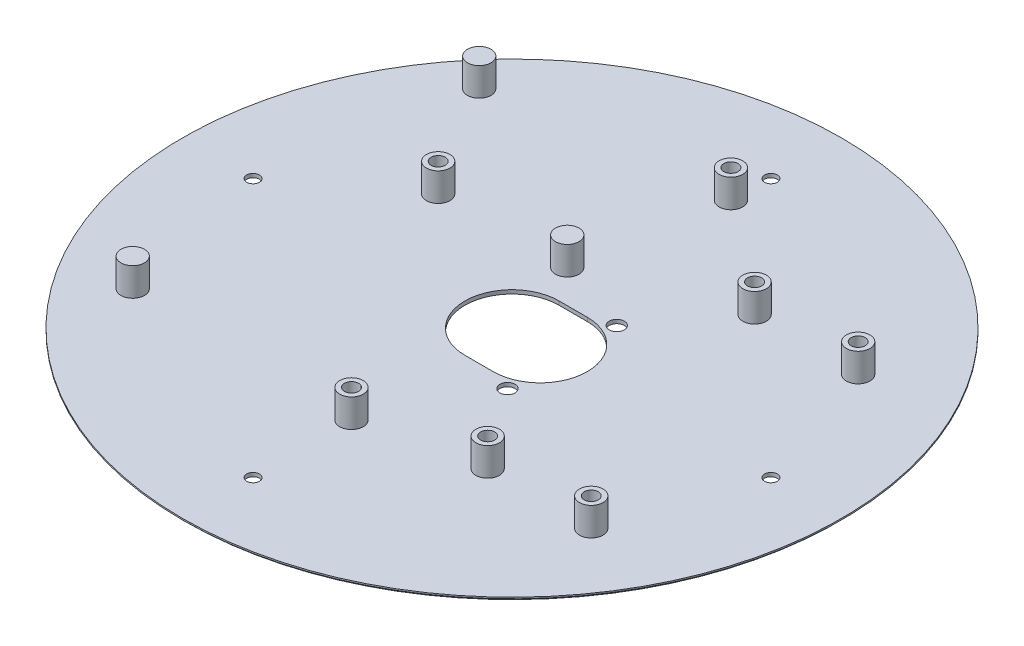
ISO-10303-21;
HEADER;
FILE_DESCRIPTION(('STEP AP214'),'2;1');
FILE_NAME('part.step','',(''),(''),'','','');
FILE_SCHEMA(('AUTOMOTIVE_DESIGN { 1 0 10303 214 1 1 1 1 }'));
ENDSEC;
DATA;
#1=APPLICATION_CONTEXT('core data for automotive mechanical design processes');
#2=APPLICATION_PROTOCOL_DEFINITION('international standard','automotive_design',2000,#1);
#3=PRODUCT_CONTEXT('',#1,'mechanical');
#4=PRODUCT('Part','Part','',(#3));
#5=PRODUCT_RELATED_PRODUCT_CATEGORY('part','',(#4));
#6=PRODUCT_DEFINITION_FORMATION('','',#4);
#7=PRODUCT_DEFINITION_CONTEXT('part definition',#1,'design');
#8=PRODUCT_DEFINITION('design','',#6,#7);
#9=PRODUCT_DEFINITION_SHAPE('','',#8);
#10=(LENGTH_UNIT() NAMED_UNIT(*) SI_UNIT(.MILLI.,.METRE.));
#11=(NAMED_UNIT(*) PLANE_ANGLE_UNIT() SI_UNIT($,.RADIAN.));
#12=(NAMED_UNIT(*) SI_UNIT($,.STERADIAN.) SOLID_ANGLE_UNIT());
#13=UNCERTAINTY_MEASURE_WITH_UNIT(LENGTH_MEASURE(1.E-05),#10,'distance_accuracy_value','');
#14=(GEOMETRIC_REPRESENTATION_CONTEXT(3) GLOBAL_UNCERTAINTY_ASSIGNED_CONTEXT((#13)) GLOBAL_UNIT_ASSIGNED_CONTEXT((#10,
#11,#12)) REPRESENTATION_CONTEXT('',''));
#15=CARTESIAN_POINT('',(0.,0.,0.));
#16=DIRECTION('',(0.,0.,1.));
#17=DIRECTION('',(1.,0.,0.));
#18=AXIS2_PLACEMENT_3D('',#15,#16,#17);
#19=CARTESIAN_POINT('',(0.,0.8,0.));
#20=DIRECTION('',(0.,-1.,0.));
#21=DIRECTION('',(0.,0.,-1.));
#22=AXIS2_PLACEMENT_3D('',#19,#20,#21);
#23=CYLINDRICAL_SURFACE('',#22,70.);
#24=CARTESIAN_POINT('',(0.,0.500000000000014,0.));
#25=DIRECTION('',(0.,1.,0.));
#26=DIRECTION('',(0.,0.,1.));
#27=AXIS2_PLACEMENT_3D('',#24,#25,#26);
#28=CIRCLE('',#27,70.);
#29=CARTESIAN_POINT('',(0.,0.500000000000014,70.));
#30=VERTEX_POINT('',#29);
#31=EDGE_CURVE('E41',#30,#30,#28,.T.);
#32=ORIENTED_EDGE('',*,*,#31,.T.);
#33=EDGE_LOOP('',(#32));
#34=FACE_BOUND('',#33,.T.);
#35=CARTESIAN_POINT('',(0.,0.8,0.));
#36=DIRECTION('',(0.,1.,0.));
#37=DIRECTION('',(0.,0.,1.));
#38=AXIS2_PLACEMENT_3D('',#35,#36,#37);
#39=CIRCLE('',#38,70.);
#40=CARTESIAN_POINT('',(0.,0.8,70.));
#41=VERTEX_POINT('',#40);
#42=EDGE_CURVE('E80',#41,#41,#39,.T.);
#43=ORIENTED_EDGE('',*,*,#42,.F.);
#44=EDGE_LOOP('',(#43));
#45=FACE_BOUND('',#44,.T.);
#46=ADVANCED_FACE('F33',(#34,#45),#23,.T.);
#47=CARTESIAN_POINT('',(0.,0.8,0.));
#48=DIRECTION('',(0.,1.,0.));
#49=DIRECTION('',(0.,0.,1.));
#50=AXIS2_PLACEMENT_3D('',#47,#48,#49);
#51=PLANE('',#50);
#52=CARTESIAN_POINT('',(10.6441872975892,0.8,11.6052369361815));
#53=DIRECTION('',(0.,1.,0.));
#54=DIRECTION('',(0.,0.,1.));
#55=AXIS2_PLACEMENT_3D('',#52,#53,#54);
#56=CIRCLE('',#55,1.6);
#57=CARTESIAN_POINT('',(10.6441872975892,0.8,13.2052369361815));
#58=VERTEX_POINT('',#57);
#59=EDGE_CURVE('E716',#58,#58,#56,.T.);
#60=ORIENTED_EDGE('',*,*,#59,.F.);
#61=EDGE_LOOP('',(#60));
#62=FACE_BOUND('',#61,.T.);
#63=CARTESIAN_POINT('',(10.6441872975892,0.8,-11.6052369361815));
#64=DIRECTION('',(0.,1.,0.));
#65=DIRECTION('',(0.,0.,1.));
#66=AXIS2_PLACEMENT_3D('',#63,#64,#65);
#67=CIRCLE('',#66,1.6);
#68=CARTESIAN_POINT('',(10.6441872975892,0.8,-10.0052369361815));
#69=VERTEX_POINT('',#68);
#70=EDGE_CURVE('E697',#69,#69,#67,.T.);
#71=ORIENTED_EDGE('',*,*,#70,.F.);
#72=EDGE_LOOP('',(#71));
#73=FACE_BOUND('',#72,.T.);
#74=CARTESIAN_POINT('',(55.,0.8,0.));
#75=DIRECTION('',(0.,1.,0.));
#76=DIRECTION('',(0.,0.,1.));
#77=AXIS2_PLACEMENT_3D('',#74,#75,#76);
#78=CIRCLE('',#77,1.35);
#79=CARTESIAN_POINT('',(55.,0.8,1.35));
#80=VERTEX_POINT('',#79);
#81=EDGE_CURVE('E706',#80,#80,#78,.F.);
#82=ORIENTED_EDGE('',*,*,#81,.T.);
#83=EDGE_LOOP('',(#82));
#84=FACE_BOUND('',#83,.T.);
#85=CARTESIAN_POINT('',(0.,0.8,-55.));
#86=DIRECTION('',(0.,1.,0.));
#87=DIRECTION('',(0.,0.,1.));
#88=AXIS2_PLACEMENT_3D('',#85,#86,#87);
#89=CIRCLE('',#88,1.35);
#90=CARTESIAN_POINT('',(0.,0.8,-53.65));
#91=VERTEX_POINT('',#90);
#92=EDGE_CURVE('E700',#91,#91,#89,.F.);
#93=ORIENTED_EDGE('',*,*,#92,.T.);
#94=EDGE_LOOP('',(#93));
#95=FACE_BOUND('',#94,.T.);
#96=CARTESIAN_POINT('',(0.,0.8,55.));
#97=DIRECTION('',(0.,1.,0.));
#98=DIRECTION('',(0.,0.,1.));
#99=AXIS2_PLACEMENT_3D('',#96,#97,#98);
#100=CIRCLE('',#99,1.35);
#101=CARTESIAN_POINT('',(0.,0.8,56.35));
#102=VERTEX_POINT('',#101);
#103=EDGE_CURVE('E693',#102,#102,#100,.F.);
#104=ORIENTED_EDGE('',*,*,#103,.T.);
#105=EDGE_LOOP('',(#104));
#106=FACE_BOUND('',#105,.T.);
#107=CARTESIAN_POINT('',(-55.,0.8,0.));
#108=DIRECTION('',(0.,1.,0.));
#109=DIRECTION('',(0.,0.,1.));
#110=AXIS2_PLACEMENT_3D('',#107,#108,#109);
#111=CIRCLE('',#110,1.35);
#112=CARTESIAN_POINT('',(-55.,0.8,1.35));
#113=VERTEX_POINT('',#112);
#114=EDGE_CURVE('E687',#113,#113,#111,.F.);
#115=ORIENTED_EDGE('',*,*,#114,.T.);
#116=EDGE_LOOP('',(#115));
#117=FACE_BOUND('',#116,.T.);
#118=CARTESIAN_POINT('',(-47.5339886149693,0.8,33.0275201405061));
#119=DIRECTION('',(0.,1.,0.));
#120=DIRECTION('',(0.,0.,1.));
#121=AXIS2_PLACEMENT_3D('',#118,#119,#120);
#122=CIRCLE('',#121,2.5);
#123=CARTESIAN_POINT('',(-47.5339886149693,0.8,35.5275201405061));
#124=VERTEX_POINT('',#123);
#125=EDGE_CURVE('E112',#124,#124,#122,.T.);
#126=ORIENTED_EDGE('',*,*,#125,.F.);
#127=EDGE_LOOP('',(#126));
#128=FACE_BOUND('',#127,.T.);
#129=CARTESIAN_POINT('',(-5.29337774476633,0.8,-17.0303035725372));
#130=DIRECTION('',(0.,1.,0.));
#131=DIRECTION('',(0.,0.,1.));
#132=AXIS2_PLACEMENT_3D('',#129,#130,#131);
#133=CIRCLE('',#132,2.5);
#134=CARTESIAN_POINT('',(-5.29337774476633,0.8,-14.5303035725372));
#135=VERTEX_POINT('',#134);
#136=EDGE_CURVE('E116',#135,#135,#133,.T.);
#137=ORIENTED_EDGE('',*,*,#136,.F.);
#138=EDGE_LOOP('',(#137));
#139=FACE_BOUND('',#138,.T.);
#140=CARTESIAN_POINT('',(-47.5339886149701,0.8,-40.5718419580567));
#141=DIRECTION('',(0.,1.,0.));
#142=DIRECTION('',(0.,0.,1.));
#143=AXIS2_PLACEMENT_3D('',#140,#141,#142);
#144=CIRCLE('',#143,2.5);
#145=CARTESIAN_POINT('',(-47.5339886149701,0.8,-38.0718419580567));
#146=VERTEX_POINT('',#145);
#147=EDGE_CURVE('E121',#146,#146,#144,.T.);
#148=ORIENTED_EDGE('',*,*,#147,.F.);
#149=EDGE_LOOP('',(#148));
#150=FACE_BOUND('',#149,.T.);
#151=CARTESIAN_POINT('',(-0.1529925208913,0.8,33.9401713357412));
#152=DIRECTION('',(0.,1.,0.));
#153=DIRECTION('',(0.,0.,1.));
#154=AXIS2_PLACEMENT_3D('',#151,#152,#153);
#155=CIRCLE('',#154,2.5);
#156=CARTESIAN_POINT('',(-0.1529925208913,0.8,36.4401713357412));
#157=VERTEX_POINT('',#156);
#158=EDGE_CURVE('E136',#157,#157,#155,.T.);
#159=ORIENTED_EDGE('',*,*,#158,.F.);
#160=EDGE_LOOP('',(#159));
#161=FACE_BOUND('',#160,.T.);
#162=CARTESIAN_POINT('',(23.2606500317656,0.8,28.4285469058722));
#163=DIRECTION('',(0.,1.,0.));
#164=DIRECTION('',(0.,0.,1.));
#165=AXIS2_PLACEMENT_3D('',#162,#163,#164);
#166=CIRCLE('',#165,2.5);
#167=CARTESIAN_POINT('',(23.2606500317656,0.8,30.9285469058722));
#168=VERTEX_POINT('',#167);
#169=EDGE_CURVE('E145',#168,#168,#166,.T.);
#170=ORIENTED_EDGE('',*,*,#169,.F.);
#171=EDGE_LOOP('',(#170));
#172=FACE_BOUND('',#171,.T.);
#173=CARTESIAN_POINT('',(45.2606500317656,0.8,28.4285469058722));
#174=DIRECTION('',(0.,1.,0.));
#175=DIRECTION('',(0.,0.,1.));
#176=AXIS2_PLACEMENT_3D('',#173,#174,#175);
#177=CIRCLE('',#176,2.5);
#178=CARTESIAN_POINT('',(45.2606500317656,0.8,30.9285469058722));
#179=VERTEX_POINT('',#178);
#180=EDGE_CURVE('E154',#179,#179,#177,.T.);
#181=ORIENTED_EDGE('',*,*,#180,.F.);
#182=EDGE_LOOP('',(#181));
#183=FACE_BOUND('',#182,.T.);
#184=CARTESIAN_POINT('',(45.2606500317656,0.8,-28.2714530941278));
#185=DIRECTION('',(0.,1.,0.));
#186=DIRECTION('',(0.,0.,1.));
#187=AXIS2_PLACEMENT_3D('',#184,#185,#186);
#188=CIRCLE('',#187,2.5);
#189=CARTESIAN_POINT('',(45.2606500317656,0.8,-25.7714530941278));
#190=VERTEX_POINT('',#189);
#191=EDGE_CURVE('E163',#190,#190,#188,.T.);
#192=ORIENTED_EDGE('',*,*,#191,.F.);
#193=EDGE_LOOP('',(#192));
#194=FACE_BOUND('',#193,.T.);
#195=CARTESIAN_POINT('',(23.2606500317656,0.8,-28.2714530941278));
#196=DIRECTION('',(0.,1.,0.));
#197=DIRECTION('',(0.,0.,1.));
#198=AXIS2_PLACEMENT_3D('',#195,#196,#197);
#199=CIRCLE('',#198,2.5);
#200=CARTESIAN_POINT('',(23.2606500317656,0.8,-25.7714530941278));
#201=VERTEX_POINT('',#200);
#202=EDGE_CURVE('E172',#201,#201,#199,.T.);
#203=ORIENTED_EDGE('',*,*,#202,.F.);
#204=EDGE_LOOP('',(#203));
#205=FACE_BOUND('',#204,.T.);
#206=CARTESIAN_POINT('',(-0.280707316952809,0.8,-46.7799523134917));
#207=DIRECTION('',(0.,1.,0.));
#208=DIRECTION('',(0.,0.,1.));
#209=AXIS2_PLACEMENT_3D('',#206,#207,#208);
#210=CIRCLE('',#209,2.5);
#211=CARTESIAN_POINT('',(-0.280707316952809,0.8,-44.2799523134917));
#212=VERTEX_POINT('',#211);
#213=EDGE_CURVE('E181',#212,#212,#210,.T.);
#214=ORIENTED_EDGE('',*,*,#213,.F.);
#215=EDGE_LOOP('',(#214));
#216=FACE_BOUND('',#215,.T.);
#217=CARTESIAN_POINT('',(-32.5331874532012,0.8,-16.8548841204044));
#218=DIRECTION('',(0.,1.,0.));
#219=DIRECTION('',(0.,0.,1.));
#220=AXIS2_PLACEMENT_3D('',#217,#218,#219);
#221=CIRCLE('',#220,2.5);
#222=CARTESIAN_POINT('',(-32.5331874532012,0.8,-14.3548841204044));
#223=VERTEX_POINT('',#222);
#224=EDGE_CURVE('E110',#223,#223,#221,.T.);
#225=ORIENTED_EDGE('',*,*,#224,.F.);
#226=EDGE_LOOP('',(#225));
#227=FACE_BOUND('',#226,.T.);
#228=CARTESIAN_POINT('',(6.,0.8,0.));
#229=DIRECTION('',(0.,1.,0.));
#230=DIRECTION('',(0.,0.,1.));
#231=AXIS2_PLACEMENT_3D('',#228,#229,#230);
#232=CIRCLE('',#231,10.);
#233=CARTESIAN_POINT('',(6.,0.8,-10.));
#234=VERTEX_POINT('',#233);
#235=CARTESIAN_POINT('',(6.,0.8,10.));
#236=VERTEX_POINT('',#235);
#237=EDGE_CURVE('E84',#234,#236,#232,.F.);
#238=ORIENTED_EDGE('',*,*,#237,.T.);
#239=DIRECTION('',(-1.,0.,0.));
#240=VECTOR('',#239,1.);
#241=CARTESIAN_POINT('',(6.,0.8,10.));
#242=LINE('',#241,#240);
#243=CARTESIAN_POINT('',(0.,0.8,10.));
#244=VERTEX_POINT('',#243);
#245=EDGE_CURVE('E73',#236,#244,#242,.T.);
#246=ORIENTED_EDGE('',*,*,#245,.T.);
#247=CARTESIAN_POINT('',(0.,0.8,0.));
#248=DIRECTION('',(0.,1.,0.));
#249=DIRECTION('',(0.,0.,1.));
#250=AXIS2_PLACEMENT_3D('',#247,#248,#249);
#251=CIRCLE('',#250,10.);
#252=CARTESIAN_POINT('',(0.,0.8,-10.));
#253=VERTEX_POINT('',#252);
#254=EDGE_CURVE('E95',#244,#253,#251,.F.);
#255=ORIENTED_EDGE('',*,*,#254,.T.);
#256=DIRECTION('',(1.,0.,0.));
#257=VECTOR('',#256,1.);
#258=CARTESIAN_POINT('',(6.,0.8,-10.));
#259=LINE('',#258,#257);
#260=EDGE_CURVE('E91',#253,#234,#259,.T.);
#261=ORIENTED_EDGE('',*,*,#260,.T.);
#262=EDGE_LOOP('',(#238,#246,#255,#261));
#263=FACE_BOUND('',#262,.T.);
#264=ORIENTED_EDGE('',*,*,#42,.T.);
#265=EDGE_LOOP('',(#264));
#266=FACE_BOUND('',#265,.T.);
#267=ADVANCED_FACE('F89',(#62,#73,#84,#95,#106,#117,#128,#139,#150,#161,#172,#183,#194,#205,
#216,#227,#263,#266),#51,.T.);
#268=CARTESIAN_POINT('',(0.,0.,0.));
#269=DIRECTION('',(0.,1.,0.));
#270=DIRECTION('',(0.,0.,1.));
#271=AXIS2_PLACEMENT_3D('',#268,#269,#270);
#272=PLANE('',#271);
#273=CARTESIAN_POINT('',(10.6441872975892,0.,11.6052369361815));
#274=DIRECTION('',(0.,-1.,0.));
#275=DIRECTION('',(0.,0.,-1.));
#276=AXIS2_PLACEMENT_3D('',#273,#274,#275);
#277=CIRCLE('',#276,1.6);
#278=CARTESIAN_POINT('',(10.6441872975892,0.,10.0052369361815));
#279=VERTEX_POINT('',#278);
#280=EDGE_CURVE('E718',#279,#279,#277,.T.);
#281=ORIENTED_EDGE('',*,*,#280,.F.);
#282=EDGE_LOOP('',(#281));
#283=FACE_BOUND('',#282,.T.);
#284=CARTESIAN_POINT('',(10.6441872975892,0.,-11.6052369361815));
#285=DIRECTION('',(0.,-1.,0.));
#286=DIRECTION('',(0.,0.,-1.));
#287=AXIS2_PLACEMENT_3D('',#284,#285,#286);
#288=CIRCLE('',#287,1.6);
#289=CARTESIAN_POINT('',(10.6441872975892,0.,-13.2052369361815));
#290=VERTEX_POINT('',#289);
#291=EDGE_CURVE('E713',#290,#290,#288,.T.);
#292=ORIENTED_EDGE('',*,*,#291,.F.);
#293=EDGE_LOOP('',(#292));
#294=FACE_BOUND('',#293,.T.);
#295=CARTESIAN_POINT('',(55.,0.,0.));
#296=DIRECTION('',(0.,-1.,0.));
#297=DIRECTION('',(0.,0.,-1.));
#298=AXIS2_PLACEMENT_3D('',#295,#296,#297);
#299=CIRCLE('',#298,1.35);
#300=CARTESIAN_POINT('',(55.,0.,-1.35));
#301=VERTEX_POINT('',#300);
#302=EDGE_CURVE('E690',#301,#301,#299,.T.);
#303=ORIENTED_EDGE('',*,*,#302,.F.);
#304=EDGE_LOOP('',(#303));
#305=FACE_BOUND('',#304,.T.);
#306=CARTESIAN_POINT('',(0.,0.,-55.));
#307=DIRECTION('',(0.,-1.,0.));
#308=DIRECTION('',(0.,0.,-1.));
#309=AXIS2_PLACEMENT_3D('',#306,#307,#308);
#310=CIRCLE('',#309,1.35);
#311=CARTESIAN_POINT('',(0.,0.,-56.35));
#312=VERTEX_POINT('',#311);
#313=EDGE_CURVE('E703',#312,#312,#310,.T.);
#314=ORIENTED_EDGE('',*,*,#313,.F.);
#315=EDGE_LOOP('',(#314));
#316=FACE_BOUND('',#315,.T.);
#317=CARTESIAN_POINT('',(0.,0.,55.));
#318=DIRECTION('',(0.,-1.,0.));
#319=DIRECTION('',(0.,0.,-1.));
#320=AXIS2_PLACEMENT_3D('',#317,#318,#319);
#321=CIRCLE('',#320,1.35);
#322=CARTESIAN_POINT('',(0.,0.,53.65));
#323=VERTEX_POINT('',#322);
#324=EDGE_CURVE('E696',#323,#323,#321,.T.);
#325=ORIENTED_EDGE('',*,*,#324,.F.);
#326=EDGE_LOOP('',(#325));
#327=FACE_BOUND('',#326,.T.);
#328=CARTESIAN_POINT('',(-55.,0.,0.));
#329=DIRECTION('',(0.,-1.,0.));
#330=DIRECTION('',(0.,0.,-1.));
#331=AXIS2_PLACEMENT_3D('',#328,#329,#330);
#332=CIRCLE('',#331,1.35);
#333=CARTESIAN_POINT('',(-55.,0.,-1.35));
#334=VERTEX_POINT('',#333);
#335=EDGE_CURVE('E683',#334,#334,#332,.T.);
#336=ORIENTED_EDGE('',*,*,#335,.F.);
#337=EDGE_LOOP('',(#336));
#338=FACE_BOUND('',#337,.T.);
#339=CARTESIAN_POINT('',(0.,0.,0.));
#340=DIRECTION('',(0.,1.,0.));
#341=DIRECTION('',(0.,0.,1.));
#342=AXIS2_PLACEMENT_3D('',#339,#340,#341);
#343=CIRCLE('',#342,69.5);
#344=CARTESIAN_POINT('',(0.,0.,69.5));
#345=VERTEX_POINT('',#344);
#346=EDGE_CURVE('E11',#345,#345,#343,.F.);
#347=ORIENTED_EDGE('',*,*,#346,.T.);
#348=EDGE_LOOP('',(#347));
#349=FACE_BOUND('',#348,.T.);
#350=CARTESIAN_POINT('',(-0.280707316952809,0.,-46.7799523134917));
#351=DIRECTION('',(0.,1.,0.));
#352=DIRECTION('',(0.,0.,1.));
#353=AXIS2_PLACEMENT_3D('',#350,#351,#352);
#354=CIRCLE('',#353,1.41008319207524);
#355=CARTESIAN_POINT('',(-0.280707316952809,0.,-45.3698691214165));
#356=VERTEX_POINT('',#355);
#357=EDGE_CURVE('E650',#356,#356,#354,.T.);
#358=ORIENTED_EDGE('',*,*,#357,.T.);
#359=EDGE_LOOP('',(#358));
#360=FACE_BOUND('',#359,.T.);
#361=CARTESIAN_POINT('',(-0.1529925208913,0.,33.9401713357412));
#362=DIRECTION('',(0.,1.,0.));
#363=DIRECTION('',(0.,0.,1.));
#364=AXIS2_PLACEMENT_3D('',#361,#362,#363);
#365=CIRCLE('',#364,1.5);
#366=CARTESIAN_POINT('',(-0.1529925208913,0.,35.4401713357412));
#367=VERTEX_POINT('',#366);
#368=EDGE_CURVE('E654',#367,#367,#365,.T.);
#369=ORIENTED_EDGE('',*,*,#368,.T.);
#370=EDGE_LOOP('',(#369));
#371=FACE_BOUND('',#370,.T.);
#372=CARTESIAN_POINT('',(23.2606500317656,0.,28.4285469058722));
#373=DIRECTION('',(0.,1.,0.));
#374=DIRECTION('',(0.,0.,1.));
#375=AXIS2_PLACEMENT_3D('',#372,#373,#374);
#376=CIRCLE('',#375,1.5);
#377=CARTESIAN_POINT('',(23.2606500317656,0.,29.9285469058722));
#378=VERTEX_POINT('',#377);
#379=EDGE_CURVE('E658',#378,#378,#376,.T.);
#380=ORIENTED_EDGE('',*,*,#379,.T.);
#381=EDGE_LOOP('',(#380));
#382=FACE_BOUND('',#381,.T.);
#383=CARTESIAN_POINT('',(45.2606500317656,0.,28.4285469058722));
#384=DIRECTION('',(0.,1.,0.));
#385=DIRECTION('',(0.,0.,1.));
#386=AXIS2_PLACEMENT_3D('',#383,#384,#385);
#387=CIRCLE('',#386,1.50000000000001);
#388=CARTESIAN_POINT('',(45.2606500317656,0.,29.9285469058722));
#389=VERTEX_POINT('',#388);
#390=EDGE_CURVE('E662',#389,#389,#387,.T.);
#391=ORIENTED_EDGE('',*,*,#390,.T.);
#392=EDGE_LOOP('',(#391));
#393=FACE_BOUND('',#392,.T.);
#394=CARTESIAN_POINT('',(45.2606500317656,0.,-28.2714530941278));
#395=DIRECTION('',(0.,1.,0.));
#396=DIRECTION('',(0.,0.,1.));
#397=AXIS2_PLACEMENT_3D('',#394,#395,#396);
#398=CIRCLE('',#397,1.5);
#399=CARTESIAN_POINT('',(45.2606500317656,0.,-26.7714530941278));
#400=VERTEX_POINT('',#399);
#401=EDGE_CURVE('E666',#400,#400,#398,.T.);
#402=ORIENTED_EDGE('',*,*,#401,.T.);
#403=EDGE_LOOP('',(#402));
#404=FACE_BOUND('',#403,.T.);
#405=CARTESIAN_POINT('',(23.2606500317656,0.,-28.2714530941278));
#406=DIRECTION('',(0.,1.,0.));
#407=DIRECTION('',(0.,0.,1.));
#408=AXIS2_PLACEMENT_3D('',#405,#406,#407);
#409=CIRCLE('',#408,1.5);
#410=CARTESIAN_POINT('',(23.2606500317656,0.,-26.7714530941278));
#411=VERTEX_POINT('',#410);
#412=EDGE_CURVE('E670',#411,#411,#409,.T.);
#413=ORIENTED_EDGE('',*,*,#412,.T.);
#414=EDGE_LOOP('',(#413));
#415=FACE_BOUND('',#414,.T.);
#416=CARTESIAN_POINT('',(-32.5331874532012,0.,-16.8548841204044));
#417=DIRECTION('',(0.,1.,0.));
#418=DIRECTION('',(0.,0.,1.));
#419=AXIS2_PLACEMENT_3D('',#416,#417,#418);
#420=CIRCLE('',#419,1.5);
#421=CARTESIAN_POINT('',(-32.5331874532012,0.,-15.3548841204044));
#422=VERTEX_POINT('',#421);
#423=EDGE_CURVE('E673',#422,#422,#420,.T.);
#424=ORIENTED_EDGE('',*,*,#423,.T.);
#425=EDGE_LOOP('',(#424));
#426=FACE_BOUND('',#425,.T.);
#427=DIRECTION('',(-1.,0.,0.));
#428=VECTOR('',#427,1.);
#429=CARTESIAN_POINT('',(6.,0.,10.));
#430=LINE('',#429,#428);
#431=CARTESIAN_POINT('',(6.,0.,10.));
#432=VERTEX_POINT('',#431);
#433=CARTESIAN_POINT('',(0.,0.,10.));
#434=VERTEX_POINT('',#433);
#435=EDGE_CURVE('E93',#432,#434,#430,.T.);
#436=ORIENTED_EDGE('',*,*,#435,.F.);
#437=CARTESIAN_POINT('',(6.,0.,0.));
#438=DIRECTION('',(0.,-1.,0.));
#439=DIRECTION('',(0.,0.,-1.));
#440=AXIS2_PLACEMENT_3D('',#437,#438,#439);
#441=CIRCLE('',#440,10.);
#442=CARTESIAN_POINT('',(6.,0.,-10.));
#443=VERTEX_POINT('',#442);
#444=EDGE_CURVE('E56',#443,#432,#441,.T.);
#445=ORIENTED_EDGE('',*,*,#444,.F.);
#446=DIRECTION('',(1.,0.,0.));
#447=VECTOR('',#446,1.);
#448=CARTESIAN_POINT('',(6.,0.,-10.));
#449=LINE('',#448,#447);
#450=CARTESIAN_POINT('',(0.,0.,-10.));
#451=VERTEX_POINT('',#450);
#452=EDGE_CURVE('E86',#451,#443,#449,.T.);
#453=ORIENTED_EDGE('',*,*,#452,.F.);
#454=CARTESIAN_POINT('',(0.,0.,0.));
#455=DIRECTION('',(0.,-1.,0.));
#456=DIRECTION('',(0.,0.,-1.));
#457=AXIS2_PLACEMENT_3D('',#454,#455,#456);
#458=CIRCLE('',#457,10.);
#459=EDGE_CURVE('E100',#434,#451,#458,.T.);
#460=ORIENTED_EDGE('',*,*,#459,.F.);
#461=EDGE_LOOP('',(#436,#445,#453,#460));
#462=FACE_BOUND('',#461,.T.);
#463=ADVANCED_FACE('F207',(#283,#294,#305,#316,#327,#338,#349,#360,#371,#382,#393,#404,#415,
#426,#462),#272,.F.);
#464=CARTESIAN_POINT('',(6.,0.801,0.));
#465=DIRECTION('',(0.,-1.,0.));
#466=DIRECTION('',(0.,0.,-1.));
#467=AXIS2_PLACEMENT_3D('',#464,#465,#466);
#468=CYLINDRICAL_SURFACE('',#467,10.);
#469=DIRECTION('',(0.,-1.,0.));
#470=VECTOR('',#469,1.);
#471=CARTESIAN_POINT('',(6.,0.801,-10.));
#472=LINE('',#471,#470);
#473=EDGE_CURVE('E81',#234,#443,#472,.T.);
#474=ORIENTED_EDGE('',*,*,#473,.T.);
#475=ORIENTED_EDGE('',*,*,#444,.T.);
#476=DIRECTION('',(0.,-1.,0.));
#477=VECTOR('',#476,1.);
#478=CARTESIAN_POINT('',(6.,0.801,10.));
#479=LINE('',#478,#477);
#480=EDGE_CURVE('E75',#236,#432,#479,.T.);
#481=ORIENTED_EDGE('',*,*,#480,.F.);
#482=ORIENTED_EDGE('',*,*,#237,.F.);
#483=EDGE_LOOP('',(#474,#475,#481,#482));
#484=FACE_BOUND('',#483,.T.);
#485=ADVANCED_FACE('F83',(#484),#468,.F.);
#486=CARTESIAN_POINT('',(6.,0.801,-10.));
#487=DIRECTION('',(0.,0.,-1.));
#488=DIRECTION('',(-1.,0.,0.));
#489=AXIS2_PLACEMENT_3D('',#486,#487,#488);
#490=PLANE('',#489);
#491=DIRECTION('',(0.,-1.,0.));
#492=VECTOR('',#491,1.);
#493=CARTESIAN_POINT('',(0.,0.801,-10.));
#494=LINE('',#493,#492);
#495=EDGE_CURVE('E106',#253,#451,#494,.T.);
#496=ORIENTED_EDGE('',*,*,#495,.T.);
#497=ORIENTED_EDGE('',*,*,#452,.T.);
#498=ORIENTED_EDGE('',*,*,#473,.F.);
#499=ORIENTED_EDGE('',*,*,#260,.F.);
#500=EDGE_LOOP('',(#496,#497,#498,#499));
#501=FACE_BOUND('',#500,.T.);
#502=ADVANCED_FACE('F205',(#501),#490,.F.);
#503=CARTESIAN_POINT('',(0.,0.801,0.));
#504=DIRECTION('',(0.,-1.,0.));
#505=DIRECTION('',(0.,0.,-1.));
#506=AXIS2_PLACEMENT_3D('',#503,#504,#505);
#507=CYLINDRICAL_SURFACE('',#506,10.);
#508=DIRECTION('',(0.,-1.,0.));
#509=VECTOR('',#508,1.);
#510=CARTESIAN_POINT('',(0.,0.801,10.));
#511=LINE('',#510,#509);
#512=EDGE_CURVE('E48',#244,#434,#511,.T.);
#513=ORIENTED_EDGE('',*,*,#512,.T.);
#514=ORIENTED_EDGE('',*,*,#459,.T.);
#515=ORIENTED_EDGE('',*,*,#495,.F.);
#516=ORIENTED_EDGE('',*,*,#254,.F.);
#517=EDGE_LOOP('',(#513,#514,#515,#516));
#518=FACE_BOUND('',#517,.T.);
#519=ADVANCED_FACE('F201',(#518),#507,.F.);
#520=CARTESIAN_POINT('',(6.,0.801,10.));
#521=DIRECTION('',(0.,0.,1.));
#522=DIRECTION('',(1.,0.,0.));
#523=AXIS2_PLACEMENT_3D('',#520,#521,#522);
#524=PLANE('',#523);
#525=ORIENTED_EDGE('',*,*,#480,.T.);
#526=ORIENTED_EDGE('',*,*,#435,.T.);
#527=ORIENTED_EDGE('',*,*,#512,.F.);
#528=ORIENTED_EDGE('',*,*,#245,.F.);
#529=EDGE_LOOP('',(#525,#526,#527,#528));
#530=FACE_BOUND('',#529,.T.);
#531=ADVANCED_FACE('F74',(#530),#524,.F.);
#532=CARTESIAN_POINT('',(-32.5331874532012,-7.07106781186548,-16.8548841204044));
#533=DIRECTION('',(0.,1.,0.));
#534=DIRECTION('',(0.,0.,1.));
#535=AXIS2_PLACEMENT_3D('',#532,#533,#534);
#536=CYLINDRICAL_SURFACE('',#535,2.5);
#537=ORIENTED_EDGE('',*,*,#224,.T.);
#538=EDGE_LOOP('',(#537));
#539=FACE_BOUND('',#538,.T.);
#540=CARTESIAN_POINT('',(-32.5331874532012,6.8,-16.8548841204044));
#541=DIRECTION('',(0.,1.,0.));
#542=DIRECTION('',(0.,0.,1.));
#543=AXIS2_PLACEMENT_3D('',#540,#541,#542);
#544=CIRCLE('',#543,2.5);
#545=CARTESIAN_POINT('',(-32.5331874532012,6.8,-14.3548841204044));
#546=VERTEX_POINT('',#545);
#547=EDGE_CURVE('E195',#546,#546,#544,.T.);
#548=ORIENTED_EDGE('',*,*,#547,.F.);
#549=EDGE_LOOP('',(#548));
#550=FACE_BOUND('',#549,.T.);
#551=ADVANCED_FACE('F390',(#539,#550),#536,.T.);
#552=CARTESIAN_POINT('',(-32.5331874532012,-7.07106781186548,-16.8548841204044));
#553=DIRECTION('',(0.,1.,0.));
#554=DIRECTION('',(0.,0.,1.));
#555=AXIS2_PLACEMENT_3D('',#552,#553,#554);
#556=CYLINDRICAL_SURFACE('',#555,1.5);
#557=CARTESIAN_POINT('',(-32.5331874532012,6.8,-16.8548841204044));
#558=DIRECTION('',(0.,1.,0.));
#559=DIRECTION('',(0.,0.,1.));
#560=AXIS2_PLACEMENT_3D('',#557,#558,#559);
#561=CIRCLE('',#560,1.5);
#562=CARTESIAN_POINT('',(-32.5331874532012,6.8,-15.3548841204044));
#563=VERTEX_POINT('',#562);
#564=EDGE_CURVE('E190',#563,#563,#561,.T.);
#565=ORIENTED_EDGE('',*,*,#564,.T.);
#566=EDGE_LOOP('',(#565));
#567=FACE_BOUND('',#566,.T.);
#568=ORIENTED_EDGE('',*,*,#423,.F.);
#569=EDGE_LOOP('',(#568));
#570=FACE_BOUND('',#569,.T.);
#571=ADVANCED_FACE('F386',(#567,#570),#556,.F.);
#572=CARTESIAN_POINT('',(-32.5331874532012,6.8,-16.8548841204044));
#573=DIRECTION('',(0.,1.,0.));
#574=DIRECTION('',(0.,0.,1.));
#575=AXIS2_PLACEMENT_3D('',#572,#573,#574);
#576=PLANE('',#575);
#577=ORIENTED_EDGE('',*,*,#547,.T.);
#578=EDGE_LOOP('',(#577));
#579=FACE_BOUND('',#578,.T.);
#580=ORIENTED_EDGE('',*,*,#564,.F.);
#581=EDGE_LOOP('',(#580));
#582=FACE_BOUND('',#581,.T.);
#583=ADVANCED_FACE('F382',(#579,#582),#576,.T.);
#584=CARTESIAN_POINT('',(-0.280707316952809,-7.07106781186548,-46.7799523134917));
#585=DIRECTION('',(0.,1.,0.));
#586=DIRECTION('',(0.,0.,1.));
#587=AXIS2_PLACEMENT_3D('',#584,#585,#586);
#588=CYLINDRICAL_SURFACE('',#587,2.5);
#589=ORIENTED_EDGE('',*,*,#213,.T.);
#590=EDGE_LOOP('',(#589));
#591=FACE_BOUND('',#590,.T.);
#592=CARTESIAN_POINT('',(-0.280707316952809,6.8,-46.7799523134917));
#593=DIRECTION('',(0.,1.,0.));
#594=DIRECTION('',(0.,0.,1.));
#595=AXIS2_PLACEMENT_3D('',#592,#593,#594);
#596=CIRCLE('',#595,2.5);
#597=CARTESIAN_POINT('',(-0.280707316952809,6.8,-44.2799523134917));
#598=VERTEX_POINT('',#597);
#599=EDGE_CURVE('E184',#598,#598,#596,.T.);
#600=ORIENTED_EDGE('',*,*,#599,.F.);
#601=EDGE_LOOP('',(#600));
#602=FACE_BOUND('',#601,.T.);
#603=ADVANCED_FACE('F378',(#591,#602),#588,.T.);
#604=CARTESIAN_POINT('',(-0.280707316952809,-7.07106781186548,-46.7799523134917));
#605=DIRECTION('',(0.,1.,0.));
#606=DIRECTION('',(0.,0.,1.));
#607=AXIS2_PLACEMENT_3D('',#604,#605,#606);
#608=CYLINDRICAL_SURFACE('',#607,1.5);
#609=CARTESIAN_POINT('',(-0.280707316952809,0.8,-46.7799523134917));
#610=DIRECTION('',(0.,1.,0.));
#611=DIRECTION('',(0.,0.,1.));
#612=AXIS2_PLACEMENT_3D('',#609,#610,#611);
#613=CIRCLE('',#612,1.5);
#614=CARTESIAN_POINT('',(-0.280707316952809,0.8,-45.2799523134917));
#615=VERTEX_POINT('',#614);
#616=EDGE_CURVE('E187',#615,#615,#613,.T.);
#617=ORIENTED_EDGE('',*,*,#616,.F.);
#618=EDGE_LOOP('',(#617));
#619=FACE_BOUND('',#618,.T.);
#620=CARTESIAN_POINT('',(-0.280707316952809,6.8,-46.7799523134917));
#621=DIRECTION('',(0.,1.,0.));
#622=DIRECTION('',(0.,0.,1.));
#623=AXIS2_PLACEMENT_3D('',#620,#621,#622);
#624=CIRCLE('',#623,1.5);
#625=CARTESIAN_POINT('',(-0.280707316952809,6.8,-45.2799523134917));
#626=VERTEX_POINT('',#625);
#627=EDGE_CURVE('E178',#626,#626,#624,.T.);
#628=ORIENTED_EDGE('',*,*,#627,.T.);
#629=EDGE_LOOP('',(#628));
#630=FACE_BOUND('',#629,.T.);
#631=ADVANCED_FACE('F374',(#619,#630),#608,.F.);
#632=CARTESIAN_POINT('',(-0.280707316952809,6.8,-46.7799523134917));
#633=DIRECTION('',(0.,1.,0.));
#634=DIRECTION('',(0.,0.,1.));
#635=AXIS2_PLACEMENT_3D('',#632,#633,#634);
#636=PLANE('',#635);
#637=ORIENTED_EDGE('',*,*,#599,.T.);
#638=EDGE_LOOP('',(#637));
#639=FACE_BOUND('',#638,.T.);
#640=ORIENTED_EDGE('',*,*,#627,.F.);
#641=EDGE_LOOP('',(#640));
#642=FACE_BOUND('',#641,.T.);
#643=ADVANCED_FACE('F371',(#639,#642),#636,.T.);
#644=CARTESIAN_POINT('',(-0.280707316952809,0.8,-46.7799523134917));
#645=DIRECTION('',(0.,1.,0.));
#646=DIRECTION('',(0.,0.,1.));
#647=AXIS2_PLACEMENT_3D('',#644,#645,#646);
#648=CIRCLE('',#647,1.41008319207524);
#649=CARTESIAN_POINT('',(-0.280707316952809,0.8,-45.3698691214165));
#650=VERTEX_POINT('',#649);
#651=EDGE_CURVE('E680',#650,#650,#648,.T.);
#652=ORIENTED_EDGE('',*,*,#651,.F.);
#653=EDGE_LOOP('',(#652));
#654=FACE_BOUND('',#653,.T.);
#655=ORIENTED_EDGE('',*,*,#616,.T.);
#656=EDGE_LOOP('',(#655));
#657=FACE_BOUND('',#656,.T.);
#658=ADVANCED_FACE('F218',(#654,#657),#51,.T.);
#659=CARTESIAN_POINT('',(23.2606500317656,-7.07106781186548,-28.2714530941278));
#660=DIRECTION('',(0.,1.,0.));
#661=DIRECTION('',(0.,0.,1.));
#662=AXIS2_PLACEMENT_3D('',#659,#660,#661);
#663=CYLINDRICAL_SURFACE('',#662,2.5);
#664=ORIENTED_EDGE('',*,*,#202,.T.);
#665=EDGE_LOOP('',(#664));
#666=FACE_BOUND('',#665,.T.);
#667=CARTESIAN_POINT('',(23.2606500317656,6.8,-28.2714530941278));
#668=DIRECTION('',(0.,1.,0.));
#669=DIRECTION('',(0.,0.,1.));
#670=AXIS2_PLACEMENT_3D('',#667,#668,#669);
#671=CIRCLE('',#670,2.5);
#672=CARTESIAN_POINT('',(23.2606500317656,6.8,-25.7714530941278));
#673=VERTEX_POINT('',#672);
#674=EDGE_CURVE('E175',#673,#673,#671,.T.);
#675=ORIENTED_EDGE('',*,*,#674,.F.);
#676=EDGE_LOOP('',(#675));
#677=FACE_BOUND('',#676,.T.);
#678=ADVANCED_FACE('F366',(#666,#677),#663,.T.);
#679=CARTESIAN_POINT('',(23.2606500317656,-7.07106781186548,-28.2714530941278));
#680=DIRECTION('',(0.,1.,0.));
#681=DIRECTION('',(0.,0.,1.));
#682=AXIS2_PLACEMENT_3D('',#679,#680,#681);
#683=CYLINDRICAL_SURFACE('',#682,1.5);
#684=CARTESIAN_POINT('',(23.2606500317656,6.8,-28.2714530941278));
#685=DIRECTION('',(0.,1.,0.));
#686=DIRECTION('',(0.,0.,1.));
#687=AXIS2_PLACEMENT_3D('',#684,#685,#686);
#688=CIRCLE('',#687,1.5);
#689=CARTESIAN_POINT('',(23.2606500317656,6.8,-26.7714530941278));
#690=VERTEX_POINT('',#689);
#691=EDGE_CURVE('E169',#690,#690,#688,.T.);
#692=ORIENTED_EDGE('',*,*,#691,.T.);
#693=EDGE_LOOP('',(#692));
#694=FACE_BOUND('',#693,.T.);
#695=ORIENTED_EDGE('',*,*,#412,.F.);
#696=EDGE_LOOP('',(#695));
#697=FACE_BOUND('',#696,.T.);
#698=ADVANCED_FACE('F362',(#694,#697),#683,.F.);
#699=CARTESIAN_POINT('',(23.2606500317656,6.8,-28.2714530941278));
#700=DIRECTION('',(0.,1.,0.));
#701=DIRECTION('',(0.,0.,1.));
#702=AXIS2_PLACEMENT_3D('',#699,#700,#701);
#703=PLANE('',#702);
#704=ORIENTED_EDGE('',*,*,#674,.T.);
#705=EDGE_LOOP('',(#704));
#706=FACE_BOUND('',#705,.T.);
#707=ORIENTED_EDGE('',*,*,#691,.F.);
#708=EDGE_LOOP('',(#707));
#709=FACE_BOUND('',#708,.T.);
#710=ADVANCED_FACE('F358',(#706,#709),#703,.T.);
#711=CARTESIAN_POINT('',(45.2606500317656,-7.07106781186548,-28.2714530941278));
#712=DIRECTION('',(0.,1.,0.));
#713=DIRECTION('',(0.,0.,1.));
#714=AXIS2_PLACEMENT_3D('',#711,#712,#713);
#715=CYLINDRICAL_SURFACE('',#714,2.5);
#716=ORIENTED_EDGE('',*,*,#191,.T.);
#717=EDGE_LOOP('',(#716));
#718=FACE_BOUND('',#717,.T.);
#719=CARTESIAN_POINT('',(45.2606500317656,6.8,-28.2714530941278));
#720=DIRECTION('',(0.,1.,0.));
#721=DIRECTION('',(0.,0.,1.));
#722=AXIS2_PLACEMENT_3D('',#719,#720,#721);
#723=CIRCLE('',#722,2.5);
#724=CARTESIAN_POINT('',(45.2606500317656,6.8,-25.7714530941278));
#725=VERTEX_POINT('',#724);
#726=EDGE_CURVE('E166',#725,#725,#723,.T.);
#727=ORIENTED_EDGE('',*,*,#726,.F.);
#728=EDGE_LOOP('',(#727));
#729=FACE_BOUND('',#728,.T.);
#730=ADVANCED_FACE('F354',(#718,#729),#715,.T.);
#731=CARTESIAN_POINT('',(45.2606500317656,-7.07106781186548,-28.2714530941278));
#732=DIRECTION('',(0.,1.,0.));
#733=DIRECTION('',(0.,0.,1.));
#734=AXIS2_PLACEMENT_3D('',#731,#732,#733);
#735=CYLINDRICAL_SURFACE('',#734,1.5);
#736=CARTESIAN_POINT('',(45.2606500317656,6.8,-28.2714530941278));
#737=DIRECTION('',(0.,1.,0.));
#738=DIRECTION('',(0.,0.,1.));
#739=AXIS2_PLACEMENT_3D('',#736,#737,#738);
#740=CIRCLE('',#739,1.5);
#741=CARTESIAN_POINT('',(45.2606500317656,6.8,-26.7714530941278));
#742=VERTEX_POINT('',#741);
#743=EDGE_CURVE('E160',#742,#742,#740,.T.);
#744=ORIENTED_EDGE('',*,*,#743,.T.);
#745=EDGE_LOOP('',(#744));
#746=FACE_BOUND('',#745,.T.);
#747=ORIENTED_EDGE('',*,*,#401,.F.);
#748=EDGE_LOOP('',(#747));
#749=FACE_BOUND('',#748,.T.);
#750=ADVANCED_FACE('F350',(#746,#749),#735,.F.);
#751=CARTESIAN_POINT('',(45.2606500317656,6.8,-28.2714530941278));
#752=DIRECTION('',(0.,1.,0.));
#753=DIRECTION('',(0.,0.,1.));
#754=AXIS2_PLACEMENT_3D('',#751,#752,#753);
#755=PLANE('',#754);
#756=ORIENTED_EDGE('',*,*,#726,.T.);
#757=EDGE_LOOP('',(#756));
#758=FACE_BOUND('',#757,.T.);
#759=ORIENTED_EDGE('',*,*,#743,.F.);
#760=EDGE_LOOP('',(#759));
#761=FACE_BOUND('',#760,.T.);
#762=ADVANCED_FACE('F346',(#758,#761),#755,.T.);
#763=CARTESIAN_POINT('',(45.2606500317656,-7.07106781186548,28.4285469058722));
#764=DIRECTION('',(0.,1.,0.));
#765=DIRECTION('',(0.,0.,1.));
#766=AXIS2_PLACEMENT_3D('',#763,#764,#765);
#767=CYLINDRICAL_SURFACE('',#766,2.5);
#768=ORIENTED_EDGE('',*,*,#180,.T.);
#769=EDGE_LOOP('',(#768));
#770=FACE_BOUND('',#769,.T.);
#771=CARTESIAN_POINT('',(45.2606500317656,6.8,28.4285469058722));
#772=DIRECTION('',(0.,1.,0.));
#773=DIRECTION('',(0.,0.,1.));
#774=AXIS2_PLACEMENT_3D('',#771,#772,#773);
#775=CIRCLE('',#774,2.5);
#776=CARTESIAN_POINT('',(45.2606500317656,6.8,30.9285469058722));
#777=VERTEX_POINT('',#776);
#778=EDGE_CURVE('E157',#777,#777,#775,.T.);
#779=ORIENTED_EDGE('',*,*,#778,.F.);
#780=EDGE_LOOP('',(#779));
#781=FACE_BOUND('',#780,.T.);
#782=ADVANCED_FACE('F342',(#770,#781),#767,.T.);
#783=CARTESIAN_POINT('',(45.2606500317656,-7.07106781186548,28.4285469058722));
#784=DIRECTION('',(0.,1.,0.));
#785=DIRECTION('',(0.,0.,1.));
#786=AXIS2_PLACEMENT_3D('',#783,#784,#785);
#787=CYLINDRICAL_SURFACE('',#786,1.5);
#788=CARTESIAN_POINT('',(45.2606500317656,6.8,28.4285469058722));
#789=DIRECTION('',(0.,1.,0.));
#790=DIRECTION('',(0.,0.,1.));
#791=AXIS2_PLACEMENT_3D('',#788,#789,#790);
#792=CIRCLE('',#791,1.5);
#793=CARTESIAN_POINT('',(45.2606500317656,6.8,29.9285469058722));
#794=VERTEX_POINT('',#793);
#795=EDGE_CURVE('E151',#794,#794,#792,.T.);
#796=ORIENTED_EDGE('',*,*,#795,.T.);
#797=EDGE_LOOP('',(#796));
#798=FACE_BOUND('',#797,.T.);
#799=ORIENTED_EDGE('',*,*,#390,.F.);
#800=EDGE_LOOP('',(#799));
#801=FACE_BOUND('',#800,.T.);
#802=ADVANCED_FACE('F338',(#798,#801),#787,.F.);
#803=CARTESIAN_POINT('',(45.2606500317656,6.8,28.4285469058722));
#804=DIRECTION('',(0.,1.,0.));
#805=DIRECTION('',(0.,0.,1.));
#806=AXIS2_PLACEMENT_3D('',#803,#804,#805);
#807=PLANE('',#806);
#808=ORIENTED_EDGE('',*,*,#778,.T.);
#809=EDGE_LOOP('',(#808));
#810=FACE_BOUND('',#809,.T.);
#811=ORIENTED_EDGE('',*,*,#795,.F.);
#812=EDGE_LOOP('',(#811));
#813=FACE_BOUND('',#812,.T.);
#814=ADVANCED_FACE('F334',(#810,#813),#807,.T.);
#815=CARTESIAN_POINT('',(23.2606500317656,-7.07106781186548,28.4285469058722));
#816=DIRECTION('',(0.,1.,0.));
#817=DIRECTION('',(0.,0.,1.));
#818=AXIS2_PLACEMENT_3D('',#815,#816,#817);
#819=CYLINDRICAL_SURFACE('',#818,2.5);
#820=ORIENTED_EDGE('',*,*,#169,.T.);
#821=EDGE_LOOP('',(#820));
#822=FACE_BOUND('',#821,.T.);
#823=CARTESIAN_POINT('',(23.2606500317656,6.8,28.4285469058722));
#824=DIRECTION('',(0.,1.,0.));
#825=DIRECTION('',(0.,0.,1.));
#826=AXIS2_PLACEMENT_3D('',#823,#824,#825);
#827=CIRCLE('',#826,2.5);
#828=CARTESIAN_POINT('',(23.2606500317656,6.8,30.9285469058722));
#829=VERTEX_POINT('',#828);
#830=EDGE_CURVE('E148',#829,#829,#827,.T.);
#831=ORIENTED_EDGE('',*,*,#830,.F.);
#832=EDGE_LOOP('',(#831));
#833=FACE_BOUND('',#832,.T.);
#834=ADVANCED_FACE('F330',(#822,#833),#819,.T.);
#835=CARTESIAN_POINT('',(23.2606500317656,-7.07106781186548,28.4285469058722));
#836=DIRECTION('',(0.,1.,0.));
#837=DIRECTION('',(0.,0.,1.));
#838=AXIS2_PLACEMENT_3D('',#835,#836,#837);
#839=CYLINDRICAL_SURFACE('',#838,1.5);
#840=CARTESIAN_POINT('',(23.2606500317656,6.8,28.4285469058722));
#841=DIRECTION('',(0.,1.,0.));
#842=DIRECTION('',(0.,0.,1.));
#843=AXIS2_PLACEMENT_3D('',#840,#841,#842);
#844=CIRCLE('',#843,1.5);
#845=CARTESIAN_POINT('',(23.2606500317656,6.8,29.9285469058722));
#846=VERTEX_POINT('',#845);
#847=EDGE_CURVE('E142',#846,#846,#844,.T.);
#848=ORIENTED_EDGE('',*,*,#847,.T.);
#849=EDGE_LOOP('',(#848));
#850=FACE_BOUND('',#849,.T.);
#851=ORIENTED_EDGE('',*,*,#379,.F.);
#852=EDGE_LOOP('',(#851));
#853=FACE_BOUND('',#852,.T.);
#854=ADVANCED_FACE('F326',(#850,#853),#839,.F.);
#855=CARTESIAN_POINT('',(23.2606500317656,6.8,28.4285469058722));
#856=DIRECTION('',(0.,1.,0.));
#857=DIRECTION('',(0.,0.,1.));
#858=AXIS2_PLACEMENT_3D('',#855,#856,#857);
#859=PLANE('',#858);
#860=ORIENTED_EDGE('',*,*,#830,.T.);
#861=EDGE_LOOP('',(#860));
#862=FACE_BOUND('',#861,.T.);
#863=ORIENTED_EDGE('',*,*,#847,.F.);
#864=EDGE_LOOP('',(#863));
#865=FACE_BOUND('',#864,.T.);
#866=ADVANCED_FACE('F322',(#862,#865),#859,.T.);
#867=CARTESIAN_POINT('',(-0.1529925208913,-7.07106781186548,33.9401713357412));
#868=DIRECTION('',(0.,1.,0.));
#869=DIRECTION('',(0.,0.,1.));
#870=AXIS2_PLACEMENT_3D('',#867,#868,#869);
#871=CYLINDRICAL_SURFACE('',#870,2.5);
#872=ORIENTED_EDGE('',*,*,#158,.T.);
#873=EDGE_LOOP('',(#872));
#874=FACE_BOUND('',#873,.T.);
#875=CARTESIAN_POINT('',(-0.1529925208913,6.8,33.9401713357412));
#876=DIRECTION('',(0.,1.,0.));
#877=DIRECTION('',(0.,0.,1.));
#878=AXIS2_PLACEMENT_3D('',#875,#876,#877);
#879=CIRCLE('',#878,2.5);
#880=CARTESIAN_POINT('',(-0.1529925208913,6.8,36.4401713357412));
#881=VERTEX_POINT('',#880);
#882=EDGE_CURVE('E139',#881,#881,#879,.T.);
#883=ORIENTED_EDGE('',*,*,#882,.F.);
#884=EDGE_LOOP('',(#883));
#885=FACE_BOUND('',#884,.T.);
#886=ADVANCED_FACE('F318',(#874,#885),#871,.T.);
#887=CARTESIAN_POINT('',(-0.1529925208913,-7.07106781186548,33.9401713357412));
#888=DIRECTION('',(0.,1.,0.));
#889=DIRECTION('',(0.,0.,1.));
#890=AXIS2_PLACEMENT_3D('',#887,#888,#889);
#891=CYLINDRICAL_SURFACE('',#890,1.5);
#892=CARTESIAN_POINT('',(-0.1529925208913,6.8,33.9401713357412));
#893=DIRECTION('',(0.,1.,0.));
#894=DIRECTION('',(0.,0.,1.));
#895=AXIS2_PLACEMENT_3D('',#892,#893,#894);
#896=CIRCLE('',#895,1.5);
#897=CARTESIAN_POINT('',(-0.1529925208913,6.8,35.4401713357412));
#898=VERTEX_POINT('',#897);
#899=EDGE_CURVE('E133',#898,#898,#896,.T.);
#900=ORIENTED_EDGE('',*,*,#899,.T.);
#901=EDGE_LOOP('',(#900));
#902=FACE_BOUND('',#901,.T.);
#903=ORIENTED_EDGE('',*,*,#368,.F.);
#904=EDGE_LOOP('',(#903));
#905=FACE_BOUND('',#904,.T.);
#906=ADVANCED_FACE('F314',(#902,#905),#891,.F.);
#907=CARTESIAN_POINT('',(-0.1529925208913,6.8,33.9401713357412));
#908=DIRECTION('',(0.,1.,0.));
#909=DIRECTION('',(0.,0.,1.));
#910=AXIS2_PLACEMENT_3D('',#907,#908,#909);
#911=PLANE('',#910);
#912=ORIENTED_EDGE('',*,*,#882,.T.);
#913=EDGE_LOOP('',(#912));
#914=FACE_BOUND('',#913,.T.);
#915=ORIENTED_EDGE('',*,*,#899,.F.);
#916=EDGE_LOOP('',(#915));
#917=FACE_BOUND('',#916,.T.);
#918=ADVANCED_FACE('F310',(#914,#917),#911,.T.);
#919=CARTESIAN_POINT('',(-47.5339886149701,-7.07106781186548,-40.5718419580567));
#920=DIRECTION('',(0.,1.,0.));
#921=DIRECTION('',(0.,0.,1.));
#922=AXIS2_PLACEMENT_3D('',#919,#920,#921);
#923=CYLINDRICAL_SURFACE('',#922,2.5);
#924=ORIENTED_EDGE('',*,*,#147,.T.);
#925=EDGE_LOOP('',(#924));
#926=FACE_BOUND('',#925,.T.);
#927=CARTESIAN_POINT('',(-47.5339886149701,6.8,-40.5718419580567));
#928=DIRECTION('',(0.,1.,0.));
#929=DIRECTION('',(0.,0.,1.));
#930=AXIS2_PLACEMENT_3D('',#927,#928,#929);
#931=CIRCLE('',#930,2.5);
#932=CARTESIAN_POINT('',(-47.5339886149701,6.8,-38.0718419580567));
#933=VERTEX_POINT('',#932);
#934=EDGE_CURVE('E129',#933,#933,#931,.T.);
#935=ORIENTED_EDGE('',*,*,#934,.F.);
#936=EDGE_LOOP('',(#935));
#937=FACE_BOUND('',#936,.T.);
#938=ADVANCED_FACE('F306',(#926,#937),#923,.T.);
#939=CARTESIAN_POINT('',(-47.5339886149701,6.8,-40.5718419580567));
#940=DIRECTION('',(0.,1.,0.));
#941=DIRECTION('',(0.,0.,1.));
#942=AXIS2_PLACEMENT_3D('',#939,#940,#941);
#943=PLANE('',#942);
#944=ORIENTED_EDGE('',*,*,#934,.T.);
#945=EDGE_LOOP('',(#944));
#946=FACE_BOUND('',#945,.T.);
#947=ADVANCED_FACE('F302',(#946),#943,.T.);
#948=CARTESIAN_POINT('',(-5.29337774476633,-7.07106781186548,-17.0303035725372));
#949=DIRECTION('',(0.,1.,0.));
#950=DIRECTION('',(0.,0.,1.));
#951=AXIS2_PLACEMENT_3D('',#948,#949,#950);
#952=CYLINDRICAL_SURFACE('',#951,2.5);
#953=ORIENTED_EDGE('',*,*,#136,.T.);
#954=EDGE_LOOP('',(#953));
#955=FACE_BOUND('',#954,.T.);
#956=CARTESIAN_POINT('',(-5.29337774476633,6.8,-17.0303035725372));
#957=DIRECTION('',(0.,1.,0.));
#958=DIRECTION('',(0.,0.,1.));
#959=AXIS2_PLACEMENT_3D('',#956,#957,#958);
#960=CIRCLE('',#959,2.5);
#961=CARTESIAN_POINT('',(-5.29337774476633,6.8,-14.5303035725372));
#962=VERTEX_POINT('',#961);
#963=EDGE_CURVE('E127',#962,#962,#960,.T.);
#964=ORIENTED_EDGE('',*,*,#963,.F.);
#965=EDGE_LOOP('',(#964));
#966=FACE_BOUND('',#965,.T.);
#967=ADVANCED_FACE('F298',(#955,#966),#952,.T.);
#968=CARTESIAN_POINT('',(-5.29337774476633,6.8,-17.0303035725372));
#969=DIRECTION('',(0.,1.,0.));
#970=DIRECTION('',(0.,0.,1.));
#971=AXIS2_PLACEMENT_3D('',#968,#969,#970);
#972=PLANE('',#971);
#973=ORIENTED_EDGE('',*,*,#963,.T.);
#974=EDGE_LOOP('',(#973));
#975=FACE_BOUND('',#974,.T.);
#976=ADVANCED_FACE('F295',(#975),#972,.T.);
#977=CARTESIAN_POINT('',(-47.5339886149693,-7.07106781186548,33.0275201405061));
#978=DIRECTION('',(0.,1.,0.));
#979=DIRECTION('',(0.,0.,1.));
#980=AXIS2_PLACEMENT_3D('',#977,#978,#979);
#981=CYLINDRICAL_SURFACE('',#980,2.5);
#982=ORIENTED_EDGE('',*,*,#125,.T.);
#983=EDGE_LOOP('',(#982));
#984=FACE_BOUND('',#983,.T.);
#985=CARTESIAN_POINT('',(-47.5339886149693,6.8,33.0275201405061));
#986=DIRECTION('',(0.,1.,0.));
#987=DIRECTION('',(0.,0.,1.));
#988=AXIS2_PLACEMENT_3D('',#985,#986,#987);
#989=CIRCLE('',#988,2.5);
#990=CARTESIAN_POINT('',(-47.5339886149693,6.8,35.5275201405061));
#991=VERTEX_POINT('',#990);
#992=EDGE_CURVE('E125',#991,#991,#989,.T.);
#993=ORIENTED_EDGE('',*,*,#992,.F.);
#994=EDGE_LOOP('',(#993));
#995=FACE_BOUND('',#994,.T.);
#996=ADVANCED_FACE('F291',(#984,#995),#981,.T.);
#997=CARTESIAN_POINT('',(-47.5339886149693,6.8,33.0275201405061));
#998=DIRECTION('',(0.,1.,0.));
#999=DIRECTION('',(0.,0.,1.));
#1000=AXIS2_PLACEMENT_3D('',#997,#998,#999);
#1001=PLANE('',#1000);
#1002=ORIENTED_EDGE('',*,*,#992,.T.);
#1003=EDGE_LOOP('',(#1002));
#1004=FACE_BOUND('',#1003,.T.);
#1005=ADVANCED_FACE('F287',(#1004),#1001,.T.);
#1006=CARTESIAN_POINT('',(-0.280707316952809,0.,-46.7799523134917));
#1007=DIRECTION('',(0.,1.,0.));
#1008=DIRECTION('',(0.,0.,1.));
#1009=AXIS2_PLACEMENT_3D('',#1006,#1007,#1008);
#1010=CYLINDRICAL_SURFACE('',#1009,1.41008319207524);
#1011=ORIENTED_EDGE('',*,*,#357,.F.);
#1012=EDGE_LOOP('',(#1011));
#1013=FACE_BOUND('',#1012,.T.);
#1014=ORIENTED_EDGE('',*,*,#651,.T.);
#1015=EDGE_LOOP('',(#1014));
#1016=FACE_BOUND('',#1015,.T.);
#1017=ADVANCED_FACE('F284',(#1013,#1016),#1010,.F.);
#1018=CARTESIAN_POINT('',(0.,0.500000000000014,0.));
#1019=DIRECTION('',(0.,1.,0.));
#1020=DIRECTION('',(0.,0.,1.));
#1021=AXIS2_PLACEMENT_3D('',#1018,#1019,#1020);
#1022=CONICAL_SURFACE('',#1021,70.,0.785398163397435);
#1023=ORIENTED_EDGE('',*,*,#346,.F.);
#1024=EDGE_LOOP('',(#1023));
#1025=FACE_BOUND('',#1024,.T.);
#1026=ORIENTED_EDGE('',*,*,#31,.F.);
#1027=EDGE_LOOP('',(#1026));
#1028=FACE_BOUND('',#1027,.T.);
#1029=ADVANCED_FACE('F35',(#1025,#1028),#1022,.T.);
#1030=CARTESIAN_POINT('',(-55.,6.801,0.));
#1031=DIRECTION('',(0.,-1.,0.));
#1032=DIRECTION('',(0.,0.,-1.));
#1033=AXIS2_PLACEMENT_3D('',#1030,#1031,#1032);
#1034=CYLINDRICAL_SURFACE('',#1033,1.35);
#1035=ORIENTED_EDGE('',*,*,#114,.F.);
#1036=EDGE_LOOP('',(#1035));
#1037=FACE_BOUND('',#1036,.T.);
#1038=ORIENTED_EDGE('',*,*,#335,.T.);
#1039=EDGE_LOOP('',(#1038));
#1040=FACE_BOUND('',#1039,.T.);
#1041=ADVANCED_FACE('F279',(#1037,#1040),#1034,.F.);
#1042=CARTESIAN_POINT('',(0.,6.801,55.));
#1043=DIRECTION('',(0.,-1.,0.));
#1044=DIRECTION('',(0.,0.,-1.));
#1045=AXIS2_PLACEMENT_3D('',#1042,#1043,#1044);
#1046=CYLINDRICAL_SURFACE('',#1045,1.35);
#1047=ORIENTED_EDGE('',*,*,#103,.F.);
#1048=EDGE_LOOP('',(#1047));
#1049=FACE_BOUND('',#1048,.T.);
#1050=ORIENTED_EDGE('',*,*,#324,.T.);
#1051=EDGE_LOOP('',(#1050));
#1052=FACE_BOUND('',#1051,.T.);
#1053=ADVANCED_FACE('F275',(#1049,#1052),#1046,.F.);
#1054=CARTESIAN_POINT('',(0.,6.801,-55.));
#1055=DIRECTION('',(0.,-1.,0.));
#1056=DIRECTION('',(0.,0.,-1.));
#1057=AXIS2_PLACEMENT_3D('',#1054,#1055,#1056);
#1058=CYLINDRICAL_SURFACE('',#1057,1.35);
#1059=ORIENTED_EDGE('',*,*,#92,.F.);
#1060=EDGE_LOOP('',(#1059));
#1061=FACE_BOUND('',#1060,.T.);
#1062=ORIENTED_EDGE('',*,*,#313,.T.);
#1063=EDGE_LOOP('',(#1062));
#1064=FACE_BOUND('',#1063,.T.);
#1065=ADVANCED_FACE('F271',(#1061,#1064),#1058,.F.);
#1066=CARTESIAN_POINT('',(55.,6.801,0.));
#1067=DIRECTION('',(0.,-1.,0.));
#1068=DIRECTION('',(0.,0.,-1.));
#1069=AXIS2_PLACEMENT_3D('',#1066,#1067,#1068);
#1070=CYLINDRICAL_SURFACE('',#1069,1.35);
#1071=ORIENTED_EDGE('',*,*,#81,.F.);
#1072=EDGE_LOOP('',(#1071));
#1073=FACE_BOUND('',#1072,.T.);
#1074=ORIENTED_EDGE('',*,*,#302,.T.);
#1075=EDGE_LOOP('',(#1074));
#1076=FACE_BOUND('',#1075,.T.);
#1077=ADVANCED_FACE('F238',(#1073,#1076),#1070,.F.);
#1078=CARTESIAN_POINT('',(10.6441872975892,4.,-11.6052369361815));
#1079=DIRECTION('',(0.,-1.,0.));
#1080=DIRECTION('',(0.,0.,-1.));
#1081=AXIS2_PLACEMENT_3D('',#1078,#1079,#1080);
#1082=CYLINDRICAL_SURFACE('',#1081,1.6);
#1083=ORIENTED_EDGE('',*,*,#70,.T.);
#1084=EDGE_LOOP('',(#1083));
#1085=FACE_BOUND('',#1084,.T.);
#1086=ORIENTED_EDGE('',*,*,#291,.T.);
#1087=EDGE_LOOP('',(#1086));
#1088=FACE_BOUND('',#1087,.T.);
#1089=ADVANCED_FACE('F248',(#1085,#1088),#1082,.F.);
#1090=CARTESIAN_POINT('',(10.6441872975892,4.,11.6052369361815));
#1091=DIRECTION('',(0.,-1.,0.));
#1092=DIRECTION('',(0.,0.,-1.));
#1093=AXIS2_PLACEMENT_3D('',#1090,#1091,#1092);
#1094=CYLINDRICAL_SURFACE('',#1093,1.6);
#1095=ORIENTED_EDGE('',*,*,#59,.T.);
#1096=EDGE_LOOP('',(#1095));
#1097=FACE_BOUND('',#1096,.T.);
#1098=ORIENTED_EDGE('',*,*,#280,.T.);
#1099=EDGE_LOOP('',(#1098));
#1100=FACE_BOUND('',#1099,.T.);
#1101=ADVANCED_FACE('F253',(#1097,#1100),#1094,.F.);
#1102=CLOSED_SHELL('',(#46,#267,#463,#485,#502,#519,#531,#551,#571,#583,#603,#631,#643,#658,
#678,#698,#710,#730,#750,#762,#782,#802,#814,#834,#854,#866,#886,#906,#918,#938,#947,#967,#976,
#996,#1005,#1017,#1029,#1041,#1053,#1065,#1077,#1089,#1101));
#1103=MANIFOLD_SOLID_BREP('B2',#1102);
#1104=ADVANCED_BREP_SHAPE_REPRESENTATION('',(#18,#1103),#14);
#1105=SHAPE_DEFINITION_REPRESENTATION(#9,#1104);
ENDSEC;
END-ISO-10303-21;
